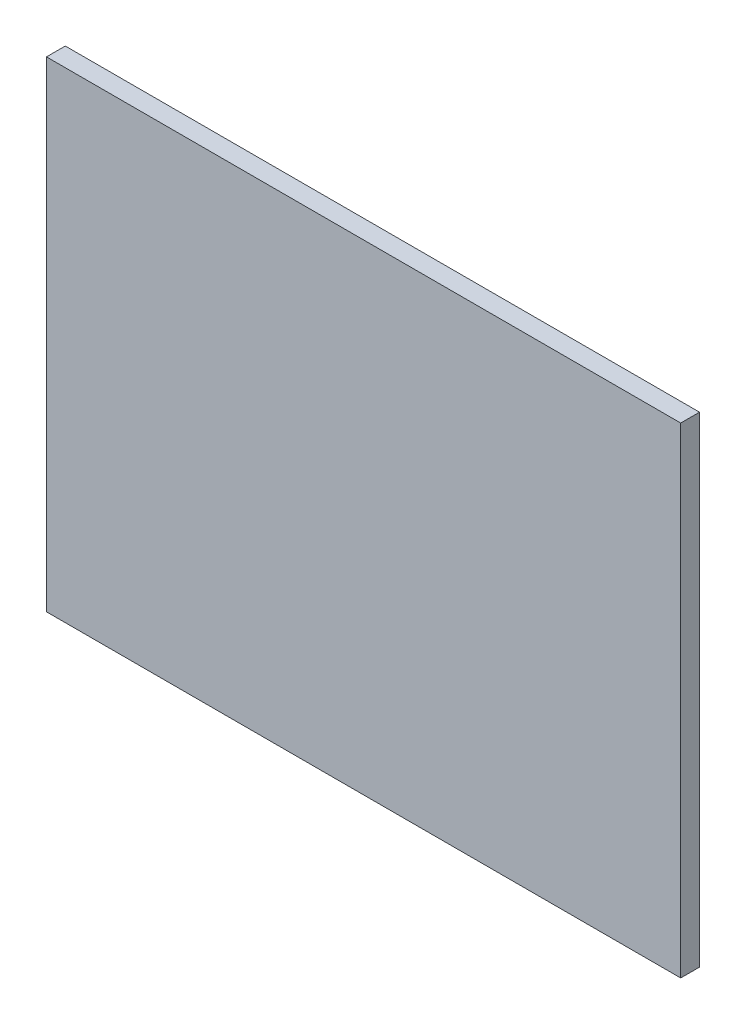
ISO-10303-21;
HEADER;
FILE_DESCRIPTION(('STEP AP214'),'2;1');
FILE_NAME('part.step','',(''),(''),'','','');
FILE_SCHEMA(('AUTOMOTIVE_DESIGN { 1 0 10303 214 1 1 1 1 }'));
ENDSEC;
DATA;
#1=APPLICATION_CONTEXT('core data for automotive mechanical design processes');
#2=APPLICATION_PROTOCOL_DEFINITION('international standard','automotive_design',2000,#1);
#3=PRODUCT_CONTEXT('',#1,'mechanical');
#4=PRODUCT('Part','Part','',(#3));
#5=PRODUCT_RELATED_PRODUCT_CATEGORY('part','',(#4));
#6=PRODUCT_DEFINITION_FORMATION('','',#4);
#7=PRODUCT_DEFINITION_CONTEXT('part definition',#1,'design');
#8=PRODUCT_DEFINITION('design','',#6,#7);
#9=PRODUCT_DEFINITION_SHAPE('','',#8);
#10=(LENGTH_UNIT() NAMED_UNIT(*) SI_UNIT(.MILLI.,.METRE.));
#11=(NAMED_UNIT(*) PLANE_ANGLE_UNIT() SI_UNIT($,.RADIAN.));
#12=(NAMED_UNIT(*) SI_UNIT($,.STERADIAN.) SOLID_ANGLE_UNIT());
#13=UNCERTAINTY_MEASURE_WITH_UNIT(LENGTH_MEASURE(1.E-05),#10,'distance_accuracy_value','');
#14=(GEOMETRIC_REPRESENTATION_CONTEXT(3) GLOBAL_UNCERTAINTY_ASSIGNED_CONTEXT((#13)) GLOBAL_UNIT_ASSIGNED_CONTEXT((#10,
#11,#12)) REPRESENTATION_CONTEXT('',''));
#15=CARTESIAN_POINT('',(0.,0.,0.));
#16=DIRECTION('',(0.,0.,1.));
#17=DIRECTION('',(1.,0.,0.));
#18=AXIS2_PLACEMENT_3D('',#15,#16,#17);
#19=CARTESIAN_POINT('',(-48.8554841897465,21.6286277427255,-1.89738));
#20=DIRECTION('',(-1.,0.,0.));
#21=DIRECTION('',(0.,-1.,0.));
#22=AXIS2_PLACEMENT_3D('',#19,#20,#21);
#23=PLANE('',#22);
#24=DIRECTION('',(0.,-1.,0.));
#25=VECTOR('',#24,1.);
#26=CARTESIAN_POINT('',(-48.8554841897465,21.6286277427255,0.));
#27=LINE('',#26,#25);
#28=CARTESIAN_POINT('',(-48.8554841897465,21.6286277427255,0.));
#29=VERTEX_POINT('',#28);
#30=CARTESIAN_POINT('',(-48.8554841897465,-26.8713722572746,0.));
#31=VERTEX_POINT('',#30);
#32=EDGE_CURVE('E99',#29,#31,#27,.T.);
#33=ORIENTED_EDGE('',*,*,#32,.F.);
#34=DIRECTION('',(0.,0.,1.));
#35=VECTOR('',#34,1.);
#36=CARTESIAN_POINT('',(-48.8554841897465,21.6286277427255,-1.89738));
#37=LINE('',#36,#35);
#38=CARTESIAN_POINT('',(-48.8554841897465,21.6286277427255,-1.89738));
#39=VERTEX_POINT('',#38);
#40=EDGE_CURVE('E11',#39,#29,#37,.T.);
#41=ORIENTED_EDGE('',*,*,#40,.F.);
#42=DIRECTION('',(0.,-1.,0.));
#43=VECTOR('',#42,1.);
#44=CARTESIAN_POINT('',(-48.8554841897465,21.6286277427255,-1.89738));
#45=LINE('',#44,#43);
#46=CARTESIAN_POINT('',(-48.8554841897465,-26.8713722572746,-1.89738));
#47=VERTEX_POINT('',#46);
#48=EDGE_CURVE('E93',#39,#47,#45,.T.);
#49=ORIENTED_EDGE('',*,*,#48,.T.);
#50=DIRECTION('',(0.,0.,1.));
#51=VECTOR('',#50,1.);
#52=CARTESIAN_POINT('',(-48.8554841897465,-26.8713722572746,-1.89738));
#53=LINE('',#52,#51);
#54=EDGE_CURVE('E38',#47,#31,#53,.T.);
#55=ORIENTED_EDGE('',*,*,#54,.T.);
#56=EDGE_LOOP('',(#33,#41,#49,#55));
#57=FACE_BOUND('',#56,.T.);
#58=ADVANCED_FACE('F35',(#57),#23,.T.);
#59=CARTESIAN_POINT('',(-48.8554841897465,21.6286277427255,-1.89738));
#60=DIRECTION('',(0.,1.,0.));
#61=DIRECTION('',(0.,0.,1.));
#62=AXIS2_PLACEMENT_3D('',#59,#60,#61);
#63=PLANE('',#62);
#64=DIRECTION('',(-1.,0.,0.));
#65=VECTOR('',#64,1.);
#66=CARTESIAN_POINT('',(-48.8554841897465,21.6286277427255,0.));
#67=LINE('',#66,#65);
#68=CARTESIAN_POINT('',(15.1445158102535,21.6286277427255,0.));
#69=VERTEX_POINT('',#68);
#70=EDGE_CURVE('E95',#69,#29,#67,.T.);
#71=ORIENTED_EDGE('',*,*,#70,.F.);
#72=DIRECTION('',(0.,0.,1.));
#73=VECTOR('',#72,1.);
#74=CARTESIAN_POINT('',(15.1445158102535,21.6286277427255,-1.89738));
#75=LINE('',#74,#73);
#76=CARTESIAN_POINT('',(15.1445158102535,21.6286277427255,-1.89738));
#77=VERTEX_POINT('',#76);
#78=EDGE_CURVE('E44',#77,#69,#75,.T.);
#79=ORIENTED_EDGE('',*,*,#78,.F.);
#80=DIRECTION('',(-1.,0.,0.));
#81=VECTOR('',#80,1.);
#82=CARTESIAN_POINT('',(-48.8554841897465,21.6286277427255,-1.89738));
#83=LINE('',#82,#81);
#84=EDGE_CURVE('E90',#77,#39,#83,.T.);
#85=ORIENTED_EDGE('',*,*,#84,.T.);
#86=ORIENTED_EDGE('',*,*,#40,.T.);
#87=EDGE_LOOP('',(#71,#79,#85,#86));
#88=FACE_BOUND('',#87,.T.);
#89=ADVANCED_FACE('F109',(#88),#63,.T.);
#90=CARTESIAN_POINT('',(15.1445158102535,21.6286277427255,-1.89738));
#91=DIRECTION('',(1.,0.,0.));
#92=DIRECTION('',(0.,1.,0.));
#93=AXIS2_PLACEMENT_3D('',#90,#91,#92);
#94=PLANE('',#93);
#95=DIRECTION('',(0.,1.,0.));
#96=VECTOR('',#95,1.);
#97=CARTESIAN_POINT('',(15.1445158102535,21.6286277427255,0.));
#98=LINE('',#97,#96);
#99=CARTESIAN_POINT('',(15.1445158102535,-26.8713722572746,0.));
#100=VERTEX_POINT('',#99);
#101=EDGE_CURVE('E85',#100,#69,#98,.T.);
#102=ORIENTED_EDGE('',*,*,#101,.F.);
#103=DIRECTION('',(0.,0.,1.));
#104=VECTOR('',#103,1.);
#105=CARTESIAN_POINT('',(15.1445158102535,-26.8713722572746,-1.89738));
#106=LINE('',#105,#104);
#107=CARTESIAN_POINT('',(15.1445158102535,-26.8713722572746,-1.89738));
#108=VERTEX_POINT('',#107);
#109=EDGE_CURVE('E80',#108,#100,#106,.T.);
#110=ORIENTED_EDGE('',*,*,#109,.F.);
#111=DIRECTION('',(0.,1.,0.));
#112=VECTOR('',#111,1.);
#113=CARTESIAN_POINT('',(15.1445158102535,21.6286277427255,-1.89738));
#114=LINE('',#113,#112);
#115=EDGE_CURVE('E83',#108,#77,#114,.T.);
#116=ORIENTED_EDGE('',*,*,#115,.T.);
#117=ORIENTED_EDGE('',*,*,#78,.T.);
#118=EDGE_LOOP('',(#102,#110,#116,#117));
#119=FACE_BOUND('',#118,.T.);
#120=ADVANCED_FACE('F82',(#119),#94,.T.);
#121=CARTESIAN_POINT('',(-48.8554841897465,-26.8713722572746,-1.89738));
#122=DIRECTION('',(0.,-1.,0.));
#123=DIRECTION('',(0.,0.,-1.));
#124=AXIS2_PLACEMENT_3D('',#121,#122,#123);
#125=PLANE('',#124);
#126=DIRECTION('',(1.,0.,0.));
#127=VECTOR('',#126,1.);
#128=CARTESIAN_POINT('',(-48.8554841897465,-26.8713722572746,0.));
#129=LINE('',#128,#127);
#130=EDGE_CURVE('E102',#31,#100,#129,.T.);
#131=ORIENTED_EDGE('',*,*,#130,.F.);
#132=ORIENTED_EDGE('',*,*,#54,.F.);
#133=DIRECTION('',(1.,0.,0.));
#134=VECTOR('',#133,1.);
#135=CARTESIAN_POINT('',(-48.8554841897465,-26.8713722572746,-1.89738));
#136=LINE('',#135,#134);
#137=EDGE_CURVE('E89',#47,#108,#136,.T.);
#138=ORIENTED_EDGE('',*,*,#137,.T.);
#139=ORIENTED_EDGE('',*,*,#109,.T.);
#140=EDGE_LOOP('',(#131,#132,#138,#139));
#141=FACE_BOUND('',#140,.T.);
#142=ADVANCED_FACE('F92',(#141),#125,.T.);
#143=CARTESIAN_POINT('',(0.,0.,-1.89738));
#144=DIRECTION('',(0.,0.,1.));
#145=DIRECTION('',(1.,0.,0.));
#146=AXIS2_PLACEMENT_3D('',#143,#144,#145);
#147=PLANE('',#146);
#148=ORIENTED_EDGE('',*,*,#48,.F.);
#149=ORIENTED_EDGE('',*,*,#84,.F.);
#150=ORIENTED_EDGE('',*,*,#115,.F.);
#151=ORIENTED_EDGE('',*,*,#137,.F.);
#152=EDGE_LOOP('',(#148,#149,#150,#151));
#153=FACE_BOUND('',#152,.T.);
#154=ADVANCED_FACE('F88',(#153),#147,.F.);
#155=CARTESIAN_POINT('',(0.,0.,0.));
#156=DIRECTION('',(0.,0.,1.));
#157=DIRECTION('',(1.,0.,0.));
#158=AXIS2_PLACEMENT_3D('',#155,#156,#157);
#159=PLANE('',#158);
#160=ORIENTED_EDGE('',*,*,#32,.T.);
#161=ORIENTED_EDGE('',*,*,#130,.T.);
#162=ORIENTED_EDGE('',*,*,#101,.T.);
#163=ORIENTED_EDGE('',*,*,#70,.T.);
#164=EDGE_LOOP('',(#160,#161,#162,#163));
#165=FACE_BOUND('',#164,.T.);
#166=ADVANCED_FACE('F108',(#165),#159,.T.);
#167=CLOSED_SHELL('',(#58,#89,#120,#142,#154,#166));
#168=MANIFOLD_SOLID_BREP('B2',#167);
#169=ADVANCED_BREP_SHAPE_REPRESENTATION('',(#18,#168),#14);
#170=SHAPE_DEFINITION_REPRESENTATION(#9,#169);
ENDSEC;
END-ISO-10303-21;
